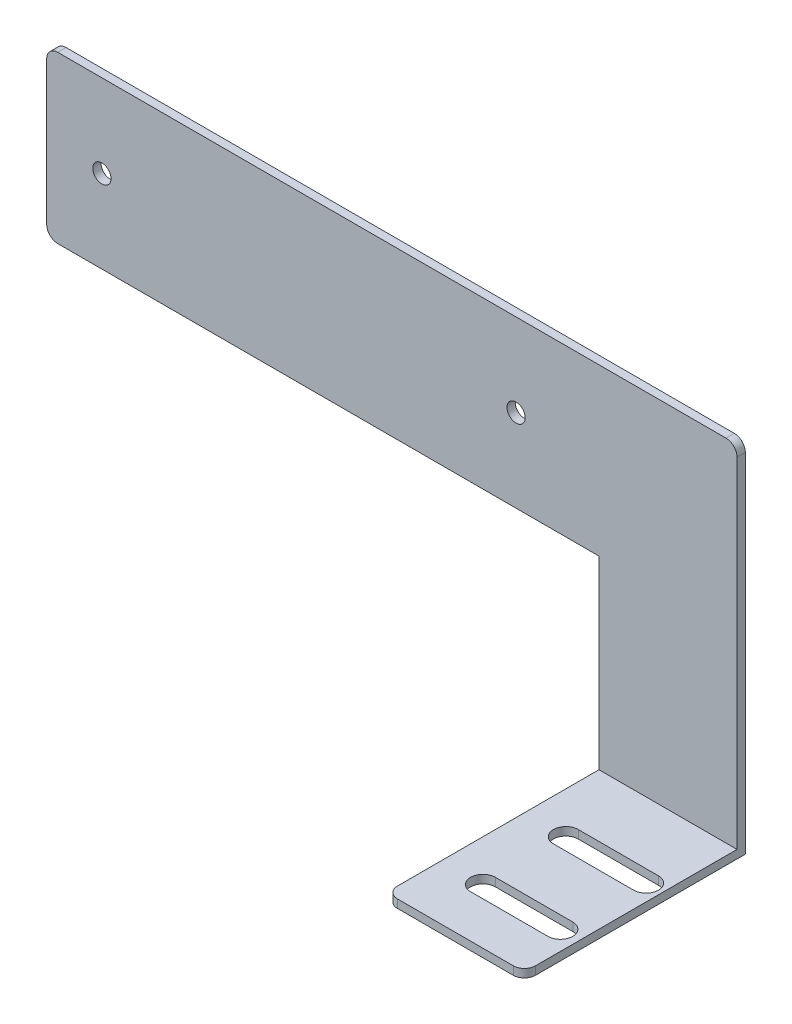
ISO-10303-21;
HEADER;
FILE_DESCRIPTION(('STEP AP214'),'2;1');
FILE_NAME('part.step','',(''),(''),'','','');
FILE_SCHEMA(('AUTOMOTIVE_DESIGN { 1 0 10303 214 1 1 1 1 }'));
ENDSEC;
DATA;
#1=APPLICATION_CONTEXT('core data for automotive mechanical design processes');
#2=APPLICATION_PROTOCOL_DEFINITION('international standard','automotive_design',2000,#1);
#3=PRODUCT_CONTEXT('',#1,'mechanical');
#4=PRODUCT('Part','Part','',(#3));
#5=PRODUCT_RELATED_PRODUCT_CATEGORY('part','',(#4));
#6=PRODUCT_DEFINITION_FORMATION('','',#4);
#7=PRODUCT_DEFINITION_CONTEXT('part definition',#1,'design');
#8=PRODUCT_DEFINITION('design','',#6,#7);
#9=PRODUCT_DEFINITION_SHAPE('','',#8);
#10=(LENGTH_UNIT() NAMED_UNIT(*) SI_UNIT(.MILLI.,.METRE.));
#11=(NAMED_UNIT(*) PLANE_ANGLE_UNIT() SI_UNIT($,.RADIAN.));
#12=(NAMED_UNIT(*) SI_UNIT($,.STERADIAN.) SOLID_ANGLE_UNIT());
#13=UNCERTAINTY_MEASURE_WITH_UNIT(LENGTH_MEASURE(1.E-05),#10,'distance_accuracy_value','');
#14=(GEOMETRIC_REPRESENTATION_CONTEXT(3) GLOBAL_UNCERTAINTY_ASSIGNED_CONTEXT((#13)) GLOBAL_UNIT_ASSIGNED_CONTEXT((#10,
#11,#12)) REPRESENTATION_CONTEXT('',''));
#15=CARTESIAN_POINT('',(0.,0.,0.));
#16=DIRECTION('',(0.,0.,1.));
#17=DIRECTION('',(1.,0.,0.));
#18=AXIS2_PLACEMENT_3D('',#15,#16,#17);
#19=CARTESIAN_POINT('',(0.,0.,1.5));
#20=DIRECTION('',(0.,0.,-1.));
#21=DIRECTION('',(-1.,0.,0.));
#22=AXIS2_PLACEMENT_3D('',#19,#20,#21);
#23=PLANE('',#22);
#24=CARTESIAN_POINT('',(-44.090560102046,-17.8301408766299,1.5));
#25=DIRECTION('',(0.,0.,1.));
#26=DIRECTION('',(1.,0.,0.));
#27=AXIS2_PLACEMENT_3D('',#24,#25,#26);
#28=CIRCLE('',#27,1.65);
#29=CARTESIAN_POINT('',(-42.440560102046,-17.8301408766299,1.5));
#30=VERTEX_POINT('',#29);
#31=EDGE_CURVE('E555',#30,#30,#28,.T.);
#32=ORIENTED_EDGE('',*,*,#31,.F.);
#33=EDGE_LOOP('',(#32));
#34=FACE_BOUND('',#33,.T.);
#35=CARTESIAN_POINT('',(30.909439897954,-17.8301408766299,1.5));
#36=DIRECTION('',(0.,0.,1.));
#37=DIRECTION('',(1.,0.,0.));
#38=AXIS2_PLACEMENT_3D('',#35,#36,#37);
#39=CIRCLE('',#38,1.65);
#40=CARTESIAN_POINT('',(32.559439897954,-17.8301408766299,1.5));
#41=VERTEX_POINT('',#40);
#42=EDGE_CURVE('E557',#41,#41,#39,.T.);
#43=ORIENTED_EDGE('',*,*,#42,.F.);
#44=EDGE_LOOP('',(#43));
#45=FACE_BOUND('',#44,.T.);
#46=DIRECTION('',(0.,1.,0.));
#47=VECTOR('',#46,1.);
#48=CARTESIAN_POINT('',(70.909439897954,-2.83014087662992,1.5));
#49=LINE('',#48,#47);
#50=CARTESIAN_POINT('',(70.909439897954,-66.3301408766299,1.5));
#51=VERTEX_POINT('',#50);
#52=CARTESIAN_POINT('',(70.909439897954,-4.83014087662992,1.5));
#53=VERTEX_POINT('',#52);
#54=EDGE_CURVE('E249',#51,#53,#49,.T.);
#55=ORIENTED_EDGE('',*,*,#54,.T.);
#56=CARTESIAN_POINT('',(68.909439897954,-4.83014087662992,1.5));
#57=DIRECTION('',(0.,0.,-1.));
#58=DIRECTION('',(-1.,0.,0.));
#59=AXIS2_PLACEMENT_3D('',#56,#57,#58);
#60=CIRCLE('',#59,2.);
#61=CARTESIAN_POINT('',(68.909439897954,-2.83014087662992,1.5));
#62=VERTEX_POINT('',#61);
#63=EDGE_CURVE('E296',#53,#62,#60,.F.);
#64=ORIENTED_EDGE('',*,*,#63,.T.);
#65=DIRECTION('',(-1.,0.,0.));
#66=VECTOR('',#65,1.);
#67=CARTESIAN_POINT('',(-54.090560102046,-2.83014087662992,1.5));
#68=LINE('',#67,#66);
#69=CARTESIAN_POINT('',(-52.090560102046,-2.83014087662992,1.5));
#70=VERTEX_POINT('',#69);
#71=EDGE_CURVE('E252',#62,#70,#68,.T.);
#72=ORIENTED_EDGE('',*,*,#71,.T.);
#73=CARTESIAN_POINT('',(-52.090560102046,-4.83014087662992,1.5));
#74=DIRECTION('',(0.,0.,-1.));
#75=DIRECTION('',(-1.,0.,0.));
#76=AXIS2_PLACEMENT_3D('',#73,#74,#75);
#77=CIRCLE('',#76,2.);
#78=CARTESIAN_POINT('',(-54.090560102046,-4.83014087662992,1.5));
#79=VERTEX_POINT('',#78);
#80=EDGE_CURVE('E292',#70,#79,#77,.F.);
#81=ORIENTED_EDGE('',*,*,#80,.T.);
#82=DIRECTION('',(0.,-1.,0.));
#83=VECTOR('',#82,1.);
#84=CARTESIAN_POINT('',(-54.090560102046,-32.8301408766299,1.5));
#85=LINE('',#84,#83);
#86=CARTESIAN_POINT('',(-54.090560102046,-30.8301408766299,1.5));
#87=VERTEX_POINT('',#86);
#88=EDGE_CURVE('E240',#79,#87,#85,.T.);
#89=ORIENTED_EDGE('',*,*,#88,.T.);
#90=CARTESIAN_POINT('',(-52.090560102046,-30.8301408766299,1.5));
#91=DIRECTION('',(0.,0.,-1.));
#92=DIRECTION('',(-1.,0.,0.));
#93=AXIS2_PLACEMENT_3D('',#90,#91,#92);
#94=CIRCLE('',#93,2.);
#95=CARTESIAN_POINT('',(-52.090560102046,-32.8301408766299,1.5));
#96=VERTEX_POINT('',#95);
#97=EDGE_CURVE('E294',#87,#96,#94,.F.);
#98=ORIENTED_EDGE('',*,*,#97,.T.);
#99=DIRECTION('',(1.,0.,0.));
#100=VECTOR('',#99,1.);
#101=CARTESIAN_POINT('',(45.909439897954,-32.8301408766299,1.5));
#102=LINE('',#101,#100);
#103=CARTESIAN_POINT('',(45.909439897954,-32.8301408766299,1.5));
#104=VERTEX_POINT('',#103);
#105=EDGE_CURVE('E243',#96,#104,#102,.T.);
#106=ORIENTED_EDGE('',*,*,#105,.T.);
#107=DIRECTION('',(0.,-1.,0.));
#108=VECTOR('',#107,1.);
#109=CARTESIAN_POINT('',(45.909439897954,-67.8301408766299,1.5));
#110=LINE('',#109,#108);
#111=CARTESIAN_POINT('',(45.909439897954,-66.3301408766299,1.5));
#112=VERTEX_POINT('',#111);
#113=EDGE_CURVE('E246',#104,#112,#110,.T.);
#114=ORIENTED_EDGE('',*,*,#113,.T.);
#115=DIRECTION('',(-1.,0.,0.));
#116=VECTOR('',#115,1.);
#117=CARTESIAN_POINT('',(45.909439897954,-66.3301408766299,1.5));
#118=LINE('',#117,#116);
#119=EDGE_CURVE('E220',#51,#112,#118,.T.);
#120=ORIENTED_EDGE('',*,*,#119,.F.);
#121=EDGE_LOOP('',(#55,#64,#72,#81,#89,#98,#106,#114,#120));
#122=FACE_BOUND('',#121,.T.);
#123=ADVANCED_FACE('F35',(#34,#45,#122),#23,.F.);
#124=CARTESIAN_POINT('',(-54.090560102046,-32.8301408766299,1.5));
#125=DIRECTION('',(1.,0.,0.));
#126=DIRECTION('',(0.,0.,-1.));
#127=AXIS2_PLACEMENT_3D('',#124,#125,#126);
#128=PLANE('',#127);
#129=DIRECTION('',(0.,-1.,0.));
#130=VECTOR('',#129,1.);
#131=CARTESIAN_POINT('',(-54.090560102046,-32.8301408766299,0.));
#132=LINE('',#131,#130);
#133=CARTESIAN_POINT('',(-54.090560102046,-4.83014087662992,0.));
#134=VERTEX_POINT('',#133);
#135=CARTESIAN_POINT('',(-54.090560102046,-30.8301408766299,0.));
#136=VERTEX_POINT('',#135);
#137=EDGE_CURVE('E239',#134,#136,#132,.T.);
#138=ORIENTED_EDGE('',*,*,#137,.T.);
#139=DIRECTION('',(0.,0.,-1.));
#140=VECTOR('',#139,1.);
#141=CARTESIAN_POINT('',(-54.090560102046,-30.8301408766299,1.5));
#142=LINE('',#141,#140);
#143=EDGE_CURVE('E320',#136,#87,#142,.F.);
#144=ORIENTED_EDGE('',*,*,#143,.T.);
#145=ORIENTED_EDGE('',*,*,#88,.F.);
#146=DIRECTION('',(0.,0.,-1.));
#147=VECTOR('',#146,1.);
#148=CARTESIAN_POINT('',(-54.090560102046,-4.83014087662992,1.5));
#149=LINE('',#148,#147);
#150=EDGE_CURVE('E317',#79,#134,#149,.T.);
#151=ORIENTED_EDGE('',*,*,#150,.T.);
#152=EDGE_LOOP('',(#138,#144,#145,#151));
#153=FACE_BOUND('',#152,.T.);
#154=ADVANCED_FACE('F358',(#153),#128,.F.);
#155=CARTESIAN_POINT('',(45.909439897954,-32.8301408766299,1.5));
#156=DIRECTION('',(0.,1.,0.));
#157=DIRECTION('',(-1.,0.,0.));
#158=AXIS2_PLACEMENT_3D('',#155,#156,#157);
#159=PLANE('',#158);
#160=ORIENTED_EDGE('',*,*,#105,.F.);
#161=DIRECTION('',(0.,0.,-1.));
#162=VECTOR('',#161,1.);
#163=CARTESIAN_POINT('',(-52.090560102046,-32.8301408766299,1.5));
#164=LINE('',#163,#162);
#165=CARTESIAN_POINT('',(-52.090560102046,-32.8301408766299,0.));
#166=VERTEX_POINT('',#165);
#167=EDGE_CURVE('E314',#96,#166,#164,.T.);
#168=ORIENTED_EDGE('',*,*,#167,.T.);
#169=DIRECTION('',(1.,0.,0.));
#170=VECTOR('',#169,1.);
#171=CARTESIAN_POINT('',(45.909439897954,-32.8301408766299,0.));
#172=LINE('',#171,#170);
#173=CARTESIAN_POINT('',(45.909439897954,-32.8301408766299,0.));
#174=VERTEX_POINT('',#173);
#175=EDGE_CURVE('E258',#166,#174,#172,.T.);
#176=ORIENTED_EDGE('',*,*,#175,.T.);
#177=DIRECTION('',(0.,0.,-1.));
#178=VECTOR('',#177,1.);
#179=CARTESIAN_POINT('',(45.909439897954,-32.8301408766299,1.5));
#180=LINE('',#179,#178);
#181=EDGE_CURVE('E274',#104,#174,#180,.T.);
#182=ORIENTED_EDGE('',*,*,#181,.F.);
#183=EDGE_LOOP('',(#160,#168,#176,#182));
#184=FACE_BOUND('',#183,.T.);
#185=ADVANCED_FACE('F364',(#184),#159,.F.);
#186=CARTESIAN_POINT('',(45.909439897954,-67.8301408766299,1.5));
#187=DIRECTION('',(1.,0.,0.));
#188=DIRECTION('',(0.,0.,-1.));
#189=AXIS2_PLACEMENT_3D('',#186,#187,#188);
#190=PLANE('',#189);
#191=DIRECTION('',(0.,0.,-1.));
#192=VECTOR('',#191,1.);
#193=CARTESIAN_POINT('',(45.909439897954,-67.8301408766299,1.5));
#194=LINE('',#193,#192);
#195=CARTESIAN_POINT('',(45.909439897954,-67.8301408766299,38.));
#196=VERTEX_POINT('',#195);
#197=CARTESIAN_POINT('',(45.909439897954,-67.8301408766299,0.));
#198=VERTEX_POINT('',#197);
#199=EDGE_CURVE('E272',#196,#198,#194,.T.);
#200=ORIENTED_EDGE('',*,*,#199,.F.);
#201=DIRECTION('',(0.,-1.,0.));
#202=VECTOR('',#201,1.);
#203=CARTESIAN_POINT('',(45.909439897954,-67.8301408766299,38.));
#204=LINE('',#203,#202);
#205=CARTESIAN_POINT('',(45.909439897954,-66.3301408766299,38.));
#206=VERTEX_POINT('',#205);
#207=EDGE_CURVE('E312',#196,#206,#204,.F.);
#208=ORIENTED_EDGE('',*,*,#207,.T.);
#209=DIRECTION('',(0.,0.,-1.));
#210=VECTOR('',#209,1.);
#211=CARTESIAN_POINT('',(45.909439897954,-66.3301408766299,40.));
#212=LINE('',#211,#210);
#213=EDGE_CURVE('E233',#206,#112,#212,.T.);
#214=ORIENTED_EDGE('',*,*,#213,.T.);
#215=ORIENTED_EDGE('',*,*,#113,.F.);
#216=ORIENTED_EDGE('',*,*,#181,.T.);
#217=DIRECTION('',(0.,-1.,0.));
#218=VECTOR('',#217,1.);
#219=CARTESIAN_POINT('',(45.909439897954,-67.8301408766299,0.));
#220=LINE('',#219,#218);
#221=EDGE_CURVE('E260',#174,#198,#220,.T.);
#222=ORIENTED_EDGE('',*,*,#221,.T.);
#223=EDGE_LOOP('',(#200,#208,#214,#215,#216,#222));
#224=FACE_BOUND('',#223,.T.);
#225=ADVANCED_FACE('F386',(#224),#190,.F.);
#226=CARTESIAN_POINT('',(70.909439897954,-67.8301408766299,1.5));
#227=DIRECTION('',(0.,1.,0.));
#228=DIRECTION('',(-1.,0.,0.));
#229=AXIS2_PLACEMENT_3D('',#226,#227,#228);
#230=PLANE('',#229);
#231=DIRECTION('',(-1.,0.,0.));
#232=VECTOR('',#231,1.);
#233=CARTESIAN_POINT('',(67.9364396333335,-67.8301408766299,17.25));
#234=LINE('',#233,#232);
#235=CARTESIAN_POINT('',(67.9364396333335,-67.8301408766299,17.25));
#236=VERTEX_POINT('',#235);
#237=CARTESIAN_POINT('',(53.409439897954,-67.8301408766299,17.25));
#238=VERTEX_POINT('',#237);
#239=EDGE_CURVE('E190',#236,#238,#234,.T.);
#240=ORIENTED_EDGE('',*,*,#239,.F.);
#241=CARTESIAN_POINT('',(67.9364396333335,-67.8301408766299,15.));
#242=DIRECTION('',(0.,-1.,0.));
#243=DIRECTION('',(1.,0.,0.));
#244=AXIS2_PLACEMENT_3D('',#241,#242,#243);
#245=CIRCLE('',#244,2.25);
#246=CARTESIAN_POINT('',(67.9364396333335,-67.8301408766299,12.75));
#247=VERTEX_POINT('',#246);
#248=EDGE_CURVE('E50',#247,#236,#245,.T.);
#249=ORIENTED_EDGE('',*,*,#248,.F.);
#250=DIRECTION('',(1.,0.,0.));
#251=VECTOR('',#250,1.);
#252=CARTESIAN_POINT('',(67.9364396333335,-67.8301408766299,12.75));
#253=LINE('',#252,#251);
#254=CARTESIAN_POINT('',(53.409439897954,-67.8301408766299,12.75));
#255=VERTEX_POINT('',#254);
#256=EDGE_CURVE('E197',#255,#247,#253,.T.);
#257=ORIENTED_EDGE('',*,*,#256,.F.);
#258=CARTESIAN_POINT('',(53.409439897954,-67.8301408766299,15.));
#259=DIRECTION('',(0.,-1.,0.));
#260=DIRECTION('',(1.,0.,0.));
#261=AXIS2_PLACEMENT_3D('',#258,#259,#260);
#262=CIRCLE('',#261,2.25);
#263=EDGE_CURVE('E181',#238,#255,#262,.T.);
#264=ORIENTED_EDGE('',*,*,#263,.F.);
#265=EDGE_LOOP('',(#240,#249,#257,#264));
#266=FACE_BOUND('',#265,.T.);
#267=DIRECTION('',(1.,0.,0.));
#268=VECTOR('',#267,1.);
#269=CARTESIAN_POINT('',(53.409439897954,-67.8301408766299,27.75));
#270=LINE('',#269,#268);
#271=CARTESIAN_POINT('',(53.409439897954,-67.8301408766299,27.75));
#272=VERTEX_POINT('',#271);
#273=CARTESIAN_POINT('',(67.4173414779467,-67.8301408766299,27.75));
#274=VERTEX_POINT('',#273);
#275=EDGE_CURVE('E208',#272,#274,#270,.T.);
#276=ORIENTED_EDGE('',*,*,#275,.F.);
#277=CARTESIAN_POINT('',(53.409439897954,-67.8301408766299,30.));
#278=DIRECTION('',(0.,-1.,0.));
#279=DIRECTION('',(1.,0.,0.));
#280=AXIS2_PLACEMENT_3D('',#277,#278,#279);
#281=CIRCLE('',#280,2.25);
#282=CARTESIAN_POINT('',(53.409439897954,-67.8301408766299,32.25));
#283=VERTEX_POINT('',#282);
#284=EDGE_CURVE('E204',#283,#272,#281,.T.);
#285=ORIENTED_EDGE('',*,*,#284,.F.);
#286=DIRECTION('',(-1.,0.,0.));
#287=VECTOR('',#286,1.);
#288=CARTESIAN_POINT('',(53.409439897954,-67.8301408766299,32.25));
#289=LINE('',#288,#287);
#290=CARTESIAN_POINT('',(67.4173414779467,-67.8301408766299,32.25));
#291=VERTEX_POINT('',#290);
#292=EDGE_CURVE('E214',#291,#283,#289,.T.);
#293=ORIENTED_EDGE('',*,*,#292,.F.);
#294=CARTESIAN_POINT('',(67.4173414779467,-67.8301408766299,30.));
#295=DIRECTION('',(0.,-1.,0.));
#296=DIRECTION('',(1.,0.,0.));
#297=AXIS2_PLACEMENT_3D('',#294,#295,#296);
#298=CIRCLE('',#297,2.25000000000001);
#299=EDGE_CURVE('E211',#274,#291,#298,.T.);
#300=ORIENTED_EDGE('',*,*,#299,.F.);
#301=EDGE_LOOP('',(#276,#285,#293,#300));
#302=FACE_BOUND('',#301,.T.);
#303=DIRECTION('',(0.,0.,-1.));
#304=VECTOR('',#303,1.);
#305=CARTESIAN_POINT('',(70.909439897954,-67.8301408766299,1.5));
#306=LINE('',#305,#304);
#307=CARTESIAN_POINT('',(70.909439897954,-67.8301408766299,38.));
#308=VERTEX_POINT('',#307);
#309=CARTESIAN_POINT('',(70.909439897954,-67.8301408766299,0.));
#310=VERTEX_POINT('',#309);
#311=EDGE_CURVE('E255',#308,#310,#306,.T.);
#312=ORIENTED_EDGE('',*,*,#311,.F.);
#313=CARTESIAN_POINT('',(68.909439897954,-67.8301408766299,38.));
#314=DIRECTION('',(0.,1.,0.));
#315=DIRECTION('',(-1.,0.,0.));
#316=AXIS2_PLACEMENT_3D('',#313,#314,#315);
#317=CIRCLE('',#316,2.);
#318=CARTESIAN_POINT('',(68.909439897954,-67.8301408766299,40.));
#319=VERTEX_POINT('',#318);
#320=EDGE_CURVE('E310',#308,#319,#317,.F.);
#321=ORIENTED_EDGE('',*,*,#320,.T.);
#322=DIRECTION('',(1.,0.,0.));
#323=VECTOR('',#322,1.);
#324=CARTESIAN_POINT('',(45.909439897954,-67.8301408766299,40.));
#325=LINE('',#324,#323);
#326=CARTESIAN_POINT('',(47.909439897954,-67.8301408766299,40.));
#327=VERTEX_POINT('',#326);
#328=EDGE_CURVE('E227',#327,#319,#325,.T.);
#329=ORIENTED_EDGE('',*,*,#328,.F.);
#330=CARTESIAN_POINT('',(47.909439897954,-67.8301408766299,38.));
#331=DIRECTION('',(0.,1.,0.));
#332=DIRECTION('',(-1.,0.,0.));
#333=AXIS2_PLACEMENT_3D('',#330,#331,#332);
#334=CIRCLE('',#333,2.);
#335=EDGE_CURVE('E308',#327,#196,#334,.F.);
#336=ORIENTED_EDGE('',*,*,#335,.T.);
#337=ORIENTED_EDGE('',*,*,#199,.T.);
#338=DIRECTION('',(1.,0.,0.));
#339=VECTOR('',#338,1.);
#340=CARTESIAN_POINT('',(70.909439897954,-67.8301408766299,0.));
#341=LINE('',#340,#339);
#342=EDGE_CURVE('E263',#198,#310,#341,.T.);
#343=ORIENTED_EDGE('',*,*,#342,.T.);
#344=EDGE_LOOP('',(#312,#321,#329,#336,#337,#343));
#345=FACE_BOUND('',#344,.T.);
#346=ADVANCED_FACE('F194',(#266,#302,#345),#230,.F.);
#347=CARTESIAN_POINT('',(70.909439897954,-2.83014087662992,1.5));
#348=DIRECTION('',(-1.,0.,0.));
#349=DIRECTION('',(0.,-1.,0.));
#350=AXIS2_PLACEMENT_3D('',#347,#348,#349);
#351=PLANE('',#350);
#352=DIRECTION('',(0.,1.,0.));
#353=VECTOR('',#352,1.);
#354=CARTESIAN_POINT('',(70.909439897954,-2.83014087662992,0.));
#355=LINE('',#354,#353);
#356=CARTESIAN_POINT('',(70.909439897954,-4.83014087662992,0.));
#357=VERTEX_POINT('',#356);
#358=EDGE_CURVE('E266',#310,#357,#355,.T.);
#359=ORIENTED_EDGE('',*,*,#358,.T.);
#360=DIRECTION('',(0.,0.,-1.));
#361=VECTOR('',#360,1.);
#362=CARTESIAN_POINT('',(70.909439897954,-4.83014087662992,1.5));
#363=LINE('',#362,#361);
#364=EDGE_CURVE('E290',#357,#53,#363,.F.);
#365=ORIENTED_EDGE('',*,*,#364,.T.);
#366=ORIENTED_EDGE('',*,*,#54,.F.);
#367=DIRECTION('',(0.,0.,-1.));
#368=VECTOR('',#367,1.);
#369=CARTESIAN_POINT('',(70.909439897954,-66.3301408766299,40.));
#370=LINE('',#369,#368);
#371=CARTESIAN_POINT('',(70.909439897954,-66.3301408766299,38.));
#372=VERTEX_POINT('',#371);
#373=EDGE_CURVE('E237',#372,#51,#370,.T.);
#374=ORIENTED_EDGE('',*,*,#373,.F.);
#375=DIRECTION('',(0.,1.,0.));
#376=VECTOR('',#375,1.);
#377=CARTESIAN_POINT('',(70.909439897954,-2.83014087662992,38.));
#378=LINE('',#377,#376);
#379=EDGE_CURVE('E288',#372,#308,#378,.F.);
#380=ORIENTED_EDGE('',*,*,#379,.T.);
#381=ORIENTED_EDGE('',*,*,#311,.T.);
#382=EDGE_LOOP('',(#359,#365,#366,#374,#380,#381));
#383=FACE_BOUND('',#382,.T.);
#384=ADVANCED_FACE('F379',(#383),#351,.F.);
#385=CARTESIAN_POINT('',(-54.090560102046,-2.83014087662992,1.5));
#386=DIRECTION('',(0.,-1.,0.));
#387=DIRECTION('',(0.,0.,-1.));
#388=AXIS2_PLACEMENT_3D('',#385,#386,#387);
#389=PLANE('',#388);
#390=ORIENTED_EDGE('',*,*,#71,.F.);
#391=DIRECTION('',(0.,0.,-1.));
#392=VECTOR('',#391,1.);
#393=CARTESIAN_POINT('',(68.909439897954,-2.83014087662992,1.5));
#394=LINE('',#393,#392);
#395=CARTESIAN_POINT('',(68.909439897954,-2.83014087662992,0.));
#396=VERTEX_POINT('',#395);
#397=EDGE_CURVE('E279',#62,#396,#394,.T.);
#398=ORIENTED_EDGE('',*,*,#397,.T.);
#399=DIRECTION('',(-1.,0.,0.));
#400=VECTOR('',#399,1.);
#401=CARTESIAN_POINT('',(-54.090560102046,-2.83014087662992,0.));
#402=LINE('',#401,#400);
#403=CARTESIAN_POINT('',(-52.090560102046,-2.83014087662992,0.));
#404=VERTEX_POINT('',#403);
#405=EDGE_CURVE('E244',#396,#404,#402,.T.);
#406=ORIENTED_EDGE('',*,*,#405,.T.);
#407=DIRECTION('',(0.,0.,-1.));
#408=VECTOR('',#407,1.);
#409=CARTESIAN_POINT('',(-52.090560102046,-2.83014087662992,1.5));
#410=LINE('',#409,#408);
#411=EDGE_CURVE('E277',#404,#70,#410,.F.);
#412=ORIENTED_EDGE('',*,*,#411,.T.);
#413=EDGE_LOOP('',(#390,#398,#406,#412));
#414=FACE_BOUND('',#413,.T.);
#415=ADVANCED_FACE('F375',(#414),#389,.F.);
#416=CARTESIAN_POINT('',(0.,0.,0.));
#417=DIRECTION('',(0.,0.,-1.));
#418=DIRECTION('',(-1.,0.,0.));
#419=AXIS2_PLACEMENT_3D('',#416,#417,#418);
#420=PLANE('',#419);
#421=CARTESIAN_POINT('',(-44.090560102046,-17.8301408766299,0.));
#422=DIRECTION('',(0.,0.,1.));
#423=DIRECTION('',(1.,0.,0.));
#424=AXIS2_PLACEMENT_3D('',#421,#422,#423);
#425=CIRCLE('',#424,1.65);
#426=CARTESIAN_POINT('',(-42.440560102046,-17.8301408766299,0.));
#427=VERTEX_POINT('',#426);
#428=EDGE_CURVE('E553',#427,#427,#425,.T.);
#429=ORIENTED_EDGE('',*,*,#428,.T.);
#430=EDGE_LOOP('',(#429));
#431=FACE_BOUND('',#430,.T.);
#432=CARTESIAN_POINT('',(30.909439897954,-17.8301408766299,0.));
#433=DIRECTION('',(0.,0.,1.));
#434=DIRECTION('',(1.,0.,0.));
#435=AXIS2_PLACEMENT_3D('',#432,#433,#434);
#436=CIRCLE('',#435,1.65);
#437=CARTESIAN_POINT('',(32.559439897954,-17.8301408766299,0.));
#438=VERTEX_POINT('',#437);
#439=EDGE_CURVE('E562',#438,#438,#436,.T.);
#440=ORIENTED_EDGE('',*,*,#439,.T.);
#441=EDGE_LOOP('',(#440));
#442=FACE_BOUND('',#441,.T.);
#443=ORIENTED_EDGE('',*,*,#405,.F.);
#444=CARTESIAN_POINT('',(68.909439897954,-4.83014087662992,0.));
#445=DIRECTION('',(0.,0.,-1.));
#446=DIRECTION('',(-1.,0.,0.));
#447=AXIS2_PLACEMENT_3D('',#444,#445,#446);
#448=CIRCLE('',#447,2.);
#449=EDGE_CURVE('E286',#396,#357,#448,.T.);
#450=ORIENTED_EDGE('',*,*,#449,.T.);
#451=ORIENTED_EDGE('',*,*,#358,.F.);
#452=ORIENTED_EDGE('',*,*,#342,.F.);
#453=ORIENTED_EDGE('',*,*,#221,.F.);
#454=ORIENTED_EDGE('',*,*,#175,.F.);
#455=CARTESIAN_POINT('',(-52.090560102046,-30.8301408766299,0.));
#456=DIRECTION('',(0.,0.,-1.));
#457=DIRECTION('',(-1.,0.,0.));
#458=AXIS2_PLACEMENT_3D('',#455,#456,#457);
#459=CIRCLE('',#458,2.);
#460=EDGE_CURVE('E284',#166,#136,#459,.T.);
#461=ORIENTED_EDGE('',*,*,#460,.T.);
#462=ORIENTED_EDGE('',*,*,#137,.F.);
#463=CARTESIAN_POINT('',(-52.090560102046,-4.83014087662992,0.));
#464=DIRECTION('',(0.,0.,-1.));
#465=DIRECTION('',(-1.,0.,0.));
#466=AXIS2_PLACEMENT_3D('',#463,#464,#465);
#467=CIRCLE('',#466,2.);
#468=EDGE_CURVE('E282',#134,#404,#467,.T.);
#469=ORIENTED_EDGE('',*,*,#468,.T.);
#470=EDGE_LOOP('',(#443,#450,#451,#452,#453,#454,#461,#462,#469));
#471=FACE_BOUND('',#470,.T.);
#472=ADVANCED_FACE('F372',(#431,#442,#471),#420,.T.);
#473=CARTESIAN_POINT('',(45.909439897954,-66.3301408766299,40.));
#474=DIRECTION('',(0.,-1.,0.));
#475=DIRECTION('',(0.,0.,-1.));
#476=AXIS2_PLACEMENT_3D('',#473,#474,#475);
#477=PLANE('',#476);
#478=DIRECTION('',(1.,0.,0.));
#479=VECTOR('',#478,1.);
#480=CARTESIAN_POINT('',(45.909439897954,-66.3301408766299,12.75));
#481=LINE('',#480,#479);
#482=CARTESIAN_POINT('',(53.409439897954,-66.3301408766299,12.75));
#483=VERTEX_POINT('',#482);
#484=CARTESIAN_POINT('',(67.9364396333335,-66.3301408766299,12.75));
#485=VERTEX_POINT('',#484);
#486=EDGE_CURVE('E43',#483,#485,#481,.T.);
#487=ORIENTED_EDGE('',*,*,#486,.T.);
#488=CARTESIAN_POINT('',(67.9364396333335,-66.3301408766299,15.));
#489=DIRECTION('',(0.,-1.,0.));
#490=DIRECTION('',(0.,0.,-1.));
#491=AXIS2_PLACEMENT_3D('',#488,#489,#490);
#492=CIRCLE('',#491,2.25);
#493=CARTESIAN_POINT('',(67.9364396333335,-66.3301408766299,17.25));
#494=VERTEX_POINT('',#493);
#495=EDGE_CURVE('E11',#485,#494,#492,.T.);
#496=ORIENTED_EDGE('',*,*,#495,.T.);
#497=DIRECTION('',(-1.,0.,0.));
#498=VECTOR('',#497,1.);
#499=CARTESIAN_POINT('',(45.909439897954,-66.3301408766299,17.25));
#500=LINE('',#499,#498);
#501=CARTESIAN_POINT('',(53.409439897954,-66.3301408766299,17.25));
#502=VERTEX_POINT('',#501);
#503=EDGE_CURVE('E334',#494,#502,#500,.T.);
#504=ORIENTED_EDGE('',*,*,#503,.T.);
#505=CARTESIAN_POINT('',(53.409439897954,-66.3301408766299,15.));
#506=DIRECTION('',(0.,-1.,0.));
#507=DIRECTION('',(0.,0.,-1.));
#508=AXIS2_PLACEMENT_3D('',#505,#506,#507);
#509=CIRCLE('',#508,2.25);
#510=EDGE_CURVE('E184',#502,#483,#509,.T.);
#511=ORIENTED_EDGE('',*,*,#510,.T.);
#512=EDGE_LOOP('',(#487,#496,#504,#511));
#513=FACE_BOUND('',#512,.T.);
#514=DIRECTION('',(-1.,0.,0.));
#515=VECTOR('',#514,1.);
#516=CARTESIAN_POINT('',(45.909439897954,-66.3301408766299,32.25));
#517=LINE('',#516,#515);
#518=CARTESIAN_POINT('',(67.4173414779467,-66.3301408766299,32.25));
#519=VERTEX_POINT('',#518);
#520=CARTESIAN_POINT('',(53.409439897954,-66.3301408766299,32.25));
#521=VERTEX_POINT('',#520);
#522=EDGE_CURVE('E328',#519,#521,#517,.T.);
#523=ORIENTED_EDGE('',*,*,#522,.T.);
#524=CARTESIAN_POINT('',(53.409439897954,-66.3301408766299,30.));
#525=DIRECTION('',(0.,-1.,0.));
#526=DIRECTION('',(0.,0.,-1.));
#527=AXIS2_PLACEMENT_3D('',#524,#525,#526);
#528=CIRCLE('',#527,2.25);
#529=CARTESIAN_POINT('',(53.409439897954,-66.3301408766299,27.75));
#530=VERTEX_POINT('',#529);
#531=EDGE_CURVE('E331',#521,#530,#528,.T.);
#532=ORIENTED_EDGE('',*,*,#531,.T.);
#533=DIRECTION('',(1.,0.,0.));
#534=VECTOR('',#533,1.);
#535=CARTESIAN_POINT('',(45.909439897954,-66.3301408766299,27.75));
#536=LINE('',#535,#534);
#537=CARTESIAN_POINT('',(67.4173414779468,-66.3301408766299,27.75));
#538=VERTEX_POINT('',#537);
#539=EDGE_CURVE('E322',#530,#538,#536,.T.);
#540=ORIENTED_EDGE('',*,*,#539,.T.);
#541=CARTESIAN_POINT('',(67.4173414779467,-66.3301408766299,30.));
#542=DIRECTION('',(0.,-1.,0.));
#543=DIRECTION('',(0.,0.,-1.));
#544=AXIS2_PLACEMENT_3D('',#541,#542,#543);
#545=CIRCLE('',#544,2.25000000000001);
#546=EDGE_CURVE('E325',#538,#519,#545,.T.);
#547=ORIENTED_EDGE('',*,*,#546,.T.);
#548=EDGE_LOOP('',(#523,#532,#540,#547));
#549=FACE_BOUND('',#548,.T.);
#550=DIRECTION('',(-1.,0.,0.));
#551=VECTOR('',#550,1.);
#552=CARTESIAN_POINT('',(45.909439897954,-66.3301408766299,40.));
#553=LINE('',#552,#551);
#554=CARTESIAN_POINT('',(68.909439897954,-66.3301408766299,40.));
#555=VERTEX_POINT('',#554);
#556=CARTESIAN_POINT('',(47.909439897954,-66.3301408766299,40.));
#557=VERTEX_POINT('',#556);
#558=EDGE_CURVE('E230',#555,#557,#553,.T.);
#559=ORIENTED_EDGE('',*,*,#558,.F.);
#560=CARTESIAN_POINT('',(68.909439897954,-66.3301408766299,38.));
#561=DIRECTION('',(0.,-1.,0.));
#562=DIRECTION('',(0.,0.,-1.));
#563=AXIS2_PLACEMENT_3D('',#560,#561,#562);
#564=CIRCLE('',#563,2.);
#565=EDGE_CURVE('E306',#555,#372,#564,.F.);
#566=ORIENTED_EDGE('',*,*,#565,.T.);
#567=ORIENTED_EDGE('',*,*,#373,.T.);
#568=ORIENTED_EDGE('',*,*,#119,.T.);
#569=ORIENTED_EDGE('',*,*,#213,.F.);
#570=CARTESIAN_POINT('',(47.909439897954,-66.3301408766299,38.));
#571=DIRECTION('',(0.,-1.,0.));
#572=DIRECTION('',(0.,0.,-1.));
#573=AXIS2_PLACEMENT_3D('',#570,#571,#572);
#574=CIRCLE('',#573,2.);
#575=EDGE_CURVE('E304',#206,#557,#574,.F.);
#576=ORIENTED_EDGE('',*,*,#575,.T.);
#577=EDGE_LOOP('',(#559,#566,#567,#568,#569,#576));
#578=FACE_BOUND('',#577,.T.);
#579=ADVANCED_FACE('F338',(#513,#549,#578),#477,.F.);
#580=CARTESIAN_POINT('',(0.,0.,40.));
#581=DIRECTION('',(0.,0.,-1.));
#582=DIRECTION('',(-1.,0.,0.));
#583=AXIS2_PLACEMENT_3D('',#580,#581,#582);
#584=PLANE('',#583);
#585=ORIENTED_EDGE('',*,*,#328,.T.);
#586=DIRECTION('',(0.,1.,0.));
#587=VECTOR('',#586,1.);
#588=CARTESIAN_POINT('',(68.909439897954,0.,40.));
#589=LINE('',#588,#587);
#590=EDGE_CURVE('E301',#319,#555,#589,.T.);
#591=ORIENTED_EDGE('',*,*,#590,.T.);
#592=ORIENTED_EDGE('',*,*,#558,.T.);
#593=DIRECTION('',(0.,-1.,0.));
#594=VECTOR('',#593,1.);
#595=CARTESIAN_POINT('',(47.909439897954,0.,40.));
#596=LINE('',#595,#594);
#597=EDGE_CURVE('E298',#557,#327,#596,.T.);
#598=ORIENTED_EDGE('',*,*,#597,.T.);
#599=EDGE_LOOP('',(#585,#591,#592,#598));
#600=FACE_BOUND('',#599,.T.);
#601=ADVANCED_FACE('F397',(#600),#584,.F.);
#602=CARTESIAN_POINT('',(68.909439897954,-4.83014087662992,1.5));
#603=DIRECTION('',(0.,0.,-1.));
#604=DIRECTION('',(-1.,0.,0.));
#605=AXIS2_PLACEMENT_3D('',#602,#603,#604);
#606=CYLINDRICAL_SURFACE('',#605,2.);
#607=ORIENTED_EDGE('',*,*,#63,.F.);
#608=ORIENTED_EDGE('',*,*,#364,.F.);
#609=ORIENTED_EDGE('',*,*,#449,.F.);
#610=ORIENTED_EDGE('',*,*,#397,.F.);
#611=EDGE_LOOP('',(#607,#608,#609,#610));
#612=FACE_BOUND('',#611,.T.);
#613=ADVANCED_FACE('F393',(#612),#606,.T.);
#614=CARTESIAN_POINT('',(68.909439897954,0.,38.));
#615=DIRECTION('',(0.,1.,0.));
#616=DIRECTION('',(-1.,0.,0.));
#617=AXIS2_PLACEMENT_3D('',#614,#615,#616);
#618=CYLINDRICAL_SURFACE('',#617,2.);
#619=ORIENTED_EDGE('',*,*,#320,.F.);
#620=ORIENTED_EDGE('',*,*,#379,.F.);
#621=ORIENTED_EDGE('',*,*,#565,.F.);
#622=ORIENTED_EDGE('',*,*,#590,.F.);
#623=EDGE_LOOP('',(#619,#620,#621,#622));
#624=FACE_BOUND('',#623,.T.);
#625=ADVANCED_FACE('F396',(#624),#618,.T.);
#626=CARTESIAN_POINT('',(47.909439897954,0.,38.));
#627=DIRECTION('',(0.,-1.,0.));
#628=DIRECTION('',(0.,0.,-1.));
#629=AXIS2_PLACEMENT_3D('',#626,#627,#628);
#630=CYLINDRICAL_SURFACE('',#629,2.);
#631=ORIENTED_EDGE('',*,*,#575,.F.);
#632=ORIENTED_EDGE('',*,*,#207,.F.);
#633=ORIENTED_EDGE('',*,*,#335,.F.);
#634=ORIENTED_EDGE('',*,*,#597,.F.);
#635=EDGE_LOOP('',(#631,#632,#633,#634));
#636=FACE_BOUND('',#635,.T.);
#637=ADVANCED_FACE('F401',(#636),#630,.T.);
#638=CARTESIAN_POINT('',(-52.090560102046,-30.8301408766299,1.5));
#639=DIRECTION('',(0.,0.,-1.));
#640=DIRECTION('',(-1.,0.,0.));
#641=AXIS2_PLACEMENT_3D('',#638,#639,#640);
#642=CYLINDRICAL_SURFACE('',#641,2.);
#643=ORIENTED_EDGE('',*,*,#97,.F.);
#644=ORIENTED_EDGE('',*,*,#143,.F.);
#645=ORIENTED_EDGE('',*,*,#460,.F.);
#646=ORIENTED_EDGE('',*,*,#167,.F.);
#647=EDGE_LOOP('',(#643,#644,#645,#646));
#648=FACE_BOUND('',#647,.T.);
#649=ADVANCED_FACE('F404',(#648),#642,.T.);
#650=CARTESIAN_POINT('',(-52.090560102046,-4.83014087662992,1.5));
#651=DIRECTION('',(0.,0.,-1.));
#652=DIRECTION('',(-1.,0.,0.));
#653=AXIS2_PLACEMENT_3D('',#650,#651,#652);
#654=CYLINDRICAL_SURFACE('',#653,2.);
#655=ORIENTED_EDGE('',*,*,#80,.F.);
#656=ORIENTED_EDGE('',*,*,#411,.F.);
#657=ORIENTED_EDGE('',*,*,#468,.F.);
#658=ORIENTED_EDGE('',*,*,#150,.F.);
#659=EDGE_LOOP('',(#655,#656,#657,#658));
#660=FACE_BOUND('',#659,.T.);
#661=ADVANCED_FACE('F37',(#660),#654,.T.);
#662=CARTESIAN_POINT('',(53.409439897954,-29.3301408766299,30.));
#663=DIRECTION('',(0.,-1.,0.));
#664=DIRECTION('',(1.,0.,0.));
#665=AXIS2_PLACEMENT_3D('',#662,#663,#664);
#666=CYLINDRICAL_SURFACE('',#665,2.25);
#667=DIRECTION('',(0.,-1.,0.));
#668=VECTOR('',#667,1.);
#669=CARTESIAN_POINT('',(53.409439897954,-29.3301408766299,32.25));
#670=LINE('',#669,#668);
#671=EDGE_CURVE('E218',#521,#283,#670,.T.);
#672=ORIENTED_EDGE('',*,*,#671,.T.);
#673=ORIENTED_EDGE('',*,*,#284,.T.);
#674=DIRECTION('',(0.,-1.,0.));
#675=VECTOR('',#674,1.);
#676=CARTESIAN_POINT('',(53.409439897954,-29.3301408766299,27.75));
#677=LINE('',#676,#675);
#678=EDGE_CURVE('E217',#530,#272,#677,.T.);
#679=ORIENTED_EDGE('',*,*,#678,.F.);
#680=ORIENTED_EDGE('',*,*,#531,.F.);
#681=EDGE_LOOP('',(#672,#673,#679,#680));
#682=FACE_BOUND('',#681,.T.);
#683=ADVANCED_FACE('F411',(#682),#666,.F.);
#684=CARTESIAN_POINT('',(53.409439897954,-29.3301408766299,32.25));
#685=DIRECTION('',(0.,0.,1.));
#686=DIRECTION('',(1.,0.,0.));
#687=AXIS2_PLACEMENT_3D('',#684,#685,#686);
#688=PLANE('',#687);
#689=DIRECTION('',(0.,-1.,0.));
#690=VECTOR('',#689,1.);
#691=CARTESIAN_POINT('',(67.4173414779468,-29.3301408766299,32.25));
#692=LINE('',#691,#690);
#693=EDGE_CURVE('E221',#519,#291,#692,.T.);
#694=ORIENTED_EDGE('',*,*,#693,.T.);
#695=ORIENTED_EDGE('',*,*,#292,.T.);
#696=ORIENTED_EDGE('',*,*,#671,.F.);
#697=ORIENTED_EDGE('',*,*,#522,.F.);
#698=EDGE_LOOP('',(#694,#695,#696,#697));
#699=FACE_BOUND('',#698,.T.);
#700=ADVANCED_FACE('F458',(#699),#688,.F.);
#701=CARTESIAN_POINT('',(67.4173414779468,-29.3301408766299,30.));
#702=DIRECTION('',(0.,-1.,0.));
#703=DIRECTION('',(1.,0.,0.));
#704=AXIS2_PLACEMENT_3D('',#701,#702,#703);
#705=CYLINDRICAL_SURFACE('',#704,2.25000000000001);
#706=DIRECTION('',(0.,-1.,0.));
#707=VECTOR('',#706,1.);
#708=CARTESIAN_POINT('',(67.4173414779468,-29.3301408766299,27.75));
#709=LINE('',#708,#707);
#710=EDGE_CURVE('E223',#538,#274,#709,.T.);
#711=ORIENTED_EDGE('',*,*,#710,.T.);
#712=ORIENTED_EDGE('',*,*,#299,.T.);
#713=ORIENTED_EDGE('',*,*,#693,.F.);
#714=ORIENTED_EDGE('',*,*,#546,.F.);
#715=EDGE_LOOP('',(#711,#712,#713,#714));
#716=FACE_BOUND('',#715,.T.);
#717=ADVANCED_FACE('F352',(#716),#705,.F.);
#718=CARTESIAN_POINT('',(53.409439897954,-29.3301408766299,27.75));
#719=DIRECTION('',(0.,0.,-1.));
#720=DIRECTION('',(-1.,0.,0.));
#721=AXIS2_PLACEMENT_3D('',#718,#719,#720);
#722=PLANE('',#721);
#723=ORIENTED_EDGE('',*,*,#678,.T.);
#724=ORIENTED_EDGE('',*,*,#275,.T.);
#725=ORIENTED_EDGE('',*,*,#710,.F.);
#726=ORIENTED_EDGE('',*,*,#539,.F.);
#727=EDGE_LOOP('',(#723,#724,#725,#726));
#728=FACE_BOUND('',#727,.T.);
#729=ADVANCED_FACE('F345',(#728),#722,.F.);
#730=CARTESIAN_POINT('',(67.9364396333335,-29.3301408766299,15.));
#731=DIRECTION('',(0.,-1.,0.));
#732=DIRECTION('',(1.,0.,0.));
#733=AXIS2_PLACEMENT_3D('',#730,#731,#732);
#734=CYLINDRICAL_SURFACE('',#733,2.25);
#735=DIRECTION('',(0.,-1.,0.));
#736=VECTOR('',#735,1.);
#737=CARTESIAN_POINT('',(67.9364396333335,-29.3301408766299,12.75));
#738=LINE('',#737,#736);
#739=EDGE_CURVE('E202',#485,#247,#738,.T.);
#740=ORIENTED_EDGE('',*,*,#739,.T.);
#741=ORIENTED_EDGE('',*,*,#248,.T.);
#742=DIRECTION('',(0.,-1.,0.));
#743=VECTOR('',#742,1.);
#744=CARTESIAN_POINT('',(67.9364396333335,-29.3301408766299,17.25));
#745=LINE('',#744,#743);
#746=EDGE_CURVE('E187',#494,#236,#745,.T.);
#747=ORIENTED_EDGE('',*,*,#746,.F.);
#748=ORIENTED_EDGE('',*,*,#495,.F.);
#749=EDGE_LOOP('',(#740,#741,#747,#748));
#750=FACE_BOUND('',#749,.T.);
#751=ADVANCED_FACE('F343',(#750),#734,.F.);
#752=CARTESIAN_POINT('',(67.9364396333335,-29.3301408766299,12.75));
#753=DIRECTION('',(0.,0.,-1.));
#754=DIRECTION('',(-1.,0.,0.));
#755=AXIS2_PLACEMENT_3D('',#752,#753,#754);
#756=PLANE('',#755);
#757=DIRECTION('',(0.,-1.,0.));
#758=VECTOR('',#757,1.);
#759=CARTESIAN_POINT('',(53.409439897954,-29.3301408766299,12.75));
#760=LINE('',#759,#758);
#761=EDGE_CURVE('E186',#483,#255,#760,.T.);
#762=ORIENTED_EDGE('',*,*,#761,.T.);
#763=ORIENTED_EDGE('',*,*,#256,.T.);
#764=ORIENTED_EDGE('',*,*,#739,.F.);
#765=ORIENTED_EDGE('',*,*,#486,.F.);
#766=EDGE_LOOP('',(#762,#763,#764,#765));
#767=FACE_BOUND('',#766,.T.);
#768=ADVANCED_FACE('F342',(#767),#756,.F.);
#769=CARTESIAN_POINT('',(53.409439897954,-29.3301408766299,15.));
#770=DIRECTION('',(0.,-1.,0.));
#771=DIRECTION('',(1.,0.,0.));
#772=AXIS2_PLACEMENT_3D('',#769,#770,#771);
#773=CYLINDRICAL_SURFACE('',#772,2.25);
#774=DIRECTION('',(0.,-1.,0.));
#775=VECTOR('',#774,1.);
#776=CARTESIAN_POINT('',(53.409439897954,-29.3301408766299,17.25));
#777=LINE('',#776,#775);
#778=EDGE_CURVE('E58',#502,#238,#777,.T.);
#779=ORIENTED_EDGE('',*,*,#778,.T.);
#780=ORIENTED_EDGE('',*,*,#263,.T.);
#781=ORIENTED_EDGE('',*,*,#761,.F.);
#782=ORIENTED_EDGE('',*,*,#510,.F.);
#783=EDGE_LOOP('',(#779,#780,#781,#782));
#784=FACE_BOUND('',#783,.T.);
#785=ADVANCED_FACE('F178',(#784),#773,.F.);
#786=CARTESIAN_POINT('',(67.9364396333335,-29.3301408766299,17.25));
#787=DIRECTION('',(0.,0.,1.));
#788=DIRECTION('',(1.,0.,0.));
#789=AXIS2_PLACEMENT_3D('',#786,#787,#788);
#790=PLANE('',#789);
#791=ORIENTED_EDGE('',*,*,#746,.T.);
#792=ORIENTED_EDGE('',*,*,#239,.T.);
#793=ORIENTED_EDGE('',*,*,#778,.F.);
#794=ORIENTED_EDGE('',*,*,#503,.F.);
#795=EDGE_LOOP('',(#791,#792,#793,#794));
#796=FACE_BOUND('',#795,.T.);
#797=ADVANCED_FACE('F191',(#796),#790,.F.);
#798=CARTESIAN_POINT('',(30.909439897954,-17.8301408766299,1.5));
#799=DIRECTION('',(0.,0.,1.));
#800=DIRECTION('',(1.,0.,0.));
#801=AXIS2_PLACEMENT_3D('',#798,#799,#800);
#802=CYLINDRICAL_SURFACE('',#801,1.65);
#803=ORIENTED_EDGE('',*,*,#439,.F.);
#804=EDGE_LOOP('',(#803));
#805=FACE_BOUND('',#804,.T.);
#806=ORIENTED_EDGE('',*,*,#42,.T.);
#807=EDGE_LOOP('',(#806));
#808=FACE_BOUND('',#807,.T.);
#809=ADVANCED_FACE('F511',(#805,#808),#802,.F.);
#810=CARTESIAN_POINT('',(-44.090560102046,-17.8301408766299,1.5));
#811=DIRECTION('',(0.,0.,1.));
#812=DIRECTION('',(1.,0.,0.));
#813=AXIS2_PLACEMENT_3D('',#810,#811,#812);
#814=CYLINDRICAL_SURFACE('',#813,1.65);
#815=ORIENTED_EDGE('',*,*,#428,.F.);
#816=EDGE_LOOP('',(#815));
#817=FACE_BOUND('',#816,.T.);
#818=ORIENTED_EDGE('',*,*,#31,.T.);
#819=EDGE_LOOP('',(#818));
#820=FACE_BOUND('',#819,.T.);
#821=ADVANCED_FACE('F533',(#817,#820),#814,.F.);
#822=CLOSED_SHELL('',(#123,#154,#185,#225,#346,#384,#415,#472,#579,#601,#613,#625,#637,#649,
#661,#683,#700,#717,#729,#751,#768,#785,#797,#809,#821));
#823=MANIFOLD_SOLID_BREP('B2',#822);
#824=ADVANCED_BREP_SHAPE_REPRESENTATION('',(#18,#823),#14);
#825=SHAPE_DEFINITION_REPRESENTATION(#9,#824);
ENDSEC;
END-ISO-10303-21;
